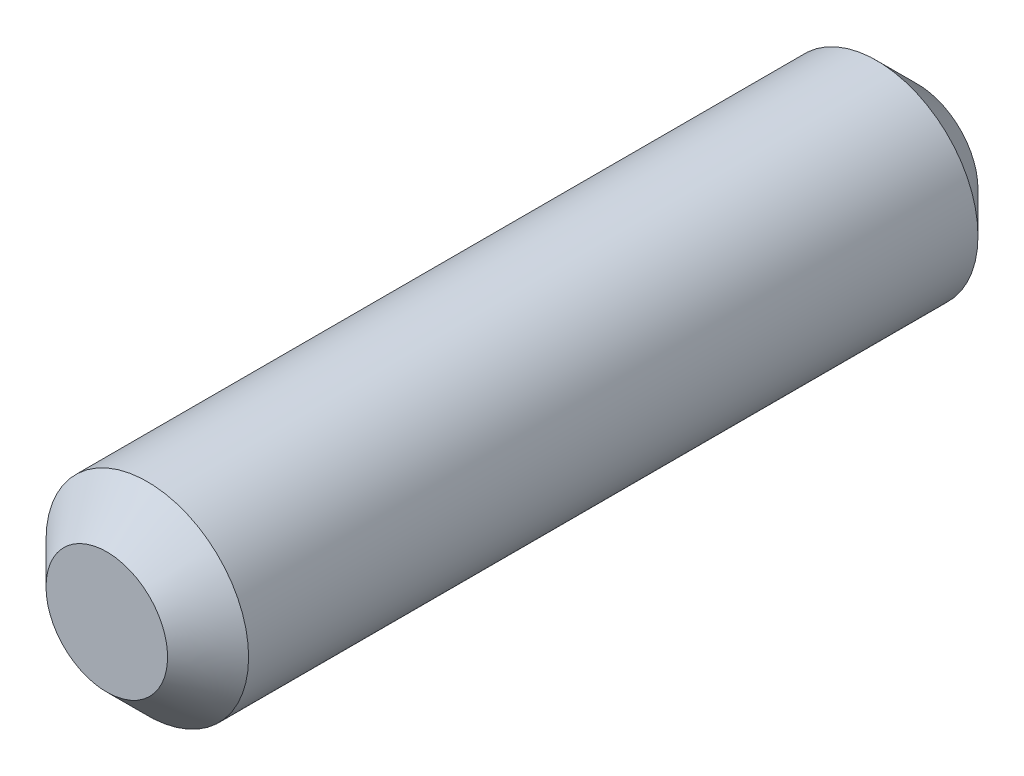
ISO-10303-21;
HEADER;
FILE_DESCRIPTION(('STEP AP214'),'2;1');
FILE_NAME('part.step','',(''),(''),'','','');
FILE_SCHEMA(('AUTOMOTIVE_DESIGN { 1 0 10303 214 1 1 1 1 }'));
ENDSEC;
DATA;
#1=APPLICATION_CONTEXT('core data for automotive mechanical design processes');
#2=APPLICATION_PROTOCOL_DEFINITION('international standard','automotive_design',2000,#1);
#3=PRODUCT_CONTEXT('',#1,'mechanical');
#4=PRODUCT('Part','Part','',(#3));
#5=PRODUCT_RELATED_PRODUCT_CATEGORY('part','',(#4));
#6=PRODUCT_DEFINITION_FORMATION('','',#4);
#7=PRODUCT_DEFINITION_CONTEXT('part definition',#1,'design');
#8=PRODUCT_DEFINITION('design','',#6,#7);
#9=PRODUCT_DEFINITION_SHAPE('','',#8);
#10=(LENGTH_UNIT() NAMED_UNIT(*) SI_UNIT(.MILLI.,.METRE.));
#11=(NAMED_UNIT(*) PLANE_ANGLE_UNIT() SI_UNIT($,.RADIAN.));
#12=(NAMED_UNIT(*) SI_UNIT($,.STERADIAN.) SOLID_ANGLE_UNIT());
#13=UNCERTAINTY_MEASURE_WITH_UNIT(LENGTH_MEASURE(1.E-05),#10,'distance_accuracy_value','');
#14=(GEOMETRIC_REPRESENTATION_CONTEXT(3) GLOBAL_UNCERTAINTY_ASSIGNED_CONTEXT((#13)) GLOBAL_UNIT_ASSIGNED_CONTEXT((#10,
#11,#12)) REPRESENTATION_CONTEXT('',''));
#15=CARTESIAN_POINT('',(0.,0.,0.));
#16=DIRECTION('',(0.,0.,1.));
#17=DIRECTION('',(1.,0.,0.));
#18=AXIS2_PLACEMENT_3D('',#15,#16,#17);
#19=CARTESIAN_POINT('',(0.,0.,0.));
#20=DIRECTION('',(0.,0.,1.));
#21=DIRECTION('',(1.,0.,0.));
#22=AXIS2_PLACEMENT_3D('',#19,#20,#21);
#23=PLANE('',#22);
#24=CARTESIAN_POINT('',(0.,0.,0.));
#25=DIRECTION('',(0.,0.,1.));
#26=DIRECTION('',(1.,0.,0.));
#27=AXIS2_PLACEMENT_3D('',#24,#25,#26);
#28=CIRCLE('',#27,0.9);
#29=CARTESIAN_POINT('',(0.9,0.,0.));
#30=VERTEX_POINT('',#29);
#31=EDGE_CURVE('E17',#30,#30,#28,.T.);
#32=ORIENTED_EDGE('',*,*,#31,.F.);
#33=EDGE_LOOP('',(#32));
#34=FACE_BOUND('',#33,.T.);
#35=ADVANCED_FACE('F14',(#34),#23,.F.);
#36=CARTESIAN_POINT('',(0.,0.,0.6));
#37=DIRECTION('',(0.,0.,1.));
#38=DIRECTION('',(1.,0.,0.));
#39=AXIS2_PLACEMENT_3D('',#36,#37,#38);
#40=CONICAL_SURFACE('',#39,1.5,0.785398163397448);
#41=CARTESIAN_POINT('',(0.,0.,0.6));
#42=DIRECTION('',(0.,0.,-1.));
#43=DIRECTION('',(-1.,0.,0.));
#44=AXIS2_PLACEMENT_3D('',#41,#42,#43);
#45=CIRCLE('',#44,1.5);
#46=CARTESIAN_POINT('',(-1.5,0.,0.6));
#47=VERTEX_POINT('',#46);
#48=EDGE_CURVE('E26',#47,#47,#45,.F.);
#49=ORIENTED_EDGE('',*,*,#48,.F.);
#50=EDGE_LOOP('',(#49));
#51=FACE_BOUND('',#50,.T.);
#52=ORIENTED_EDGE('',*,*,#31,.T.);
#53=EDGE_LOOP('',(#52));
#54=FACE_BOUND('',#53,.T.);
#55=ADVANCED_FACE('F37',(#51,#54),#40,.T.);
#56=CARTESIAN_POINT('',(0.,0.,12.));
#57=DIRECTION('',(0.,0.,1.));
#58=DIRECTION('',(1.,0.,0.));
#59=AXIS2_PLACEMENT_3D('',#56,#57,#58);
#60=PLANE('',#59);
#61=CARTESIAN_POINT('',(0.,0.,12.));
#62=DIRECTION('',(0.,0.,-1.));
#63=DIRECTION('',(-1.,0.,0.));
#64=AXIS2_PLACEMENT_3D('',#61,#62,#63);
#65=CIRCLE('',#64,0.89999999999999);
#66=CARTESIAN_POINT('',(-0.89999999999999,0.,12.));
#67=VERTEX_POINT('',#66);
#68=EDGE_CURVE('E21',#67,#67,#65,.T.);
#69=ORIENTED_EDGE('',*,*,#68,.F.);
#70=EDGE_LOOP('',(#69));
#71=FACE_BOUND('',#70,.T.);
#72=ADVANCED_FACE('F44',(#71),#60,.T.);
#73=CARTESIAN_POINT('',(0.,0.,0.6));
#74=DIRECTION('',(0.,0.,-1.));
#75=DIRECTION('',(-1.,0.,0.));
#76=AXIS2_PLACEMENT_3D('',#73,#74,#75);
#77=CYLINDRICAL_SURFACE('',#76,1.5);
#78=ORIENTED_EDGE('',*,*,#48,.T.);
#79=EDGE_LOOP('',(#78));
#80=FACE_BOUND('',#79,.T.);
#81=CARTESIAN_POINT('',(0.,0.,11.4000000000001));
#82=DIRECTION('',(0.,0.,-1.));
#83=DIRECTION('',(-1.,0.,0.));
#84=AXIS2_PLACEMENT_3D('',#81,#82,#83);
#85=CIRCLE('',#84,1.5);
#86=CARTESIAN_POINT('',(-1.5,0.,11.4));
#87=VERTEX_POINT('',#86);
#88=EDGE_CURVE('E10',#87,#87,#85,.F.);
#89=ORIENTED_EDGE('',*,*,#88,.F.);
#90=EDGE_LOOP('',(#89));
#91=FACE_BOUND('',#90,.T.);
#92=ADVANCED_FACE('F48',(#80,#91),#77,.T.);
#93=CARTESIAN_POINT('',(0.,0.,11.4));
#94=DIRECTION('',(0.,0.,-1.));
#95=DIRECTION('',(-1.,0.,0.));
#96=AXIS2_PLACEMENT_3D('',#93,#94,#95);
#97=CONICAL_SURFACE('',#96,1.5,0.785398163397448);
#98=ORIENTED_EDGE('',*,*,#68,.T.);
#99=EDGE_LOOP('',(#98));
#100=FACE_BOUND('',#99,.T.);
#101=ORIENTED_EDGE('',*,*,#88,.T.);
#102=EDGE_LOOP('',(#101));
#103=FACE_BOUND('',#102,.T.);
#104=ADVANCED_FACE('F46',(#100,#103),#97,.T.);
#105=CLOSED_SHELL('',(#35,#55,#72,#92,#104));
#106=MANIFOLD_SOLID_BREP('B1',#105);
#107=ADVANCED_BREP_SHAPE_REPRESENTATION('',(#18,#106),#14);
#108=SHAPE_DEFINITION_REPRESENTATION(#9,#107);
ENDSEC;
END-ISO-10303-21;
